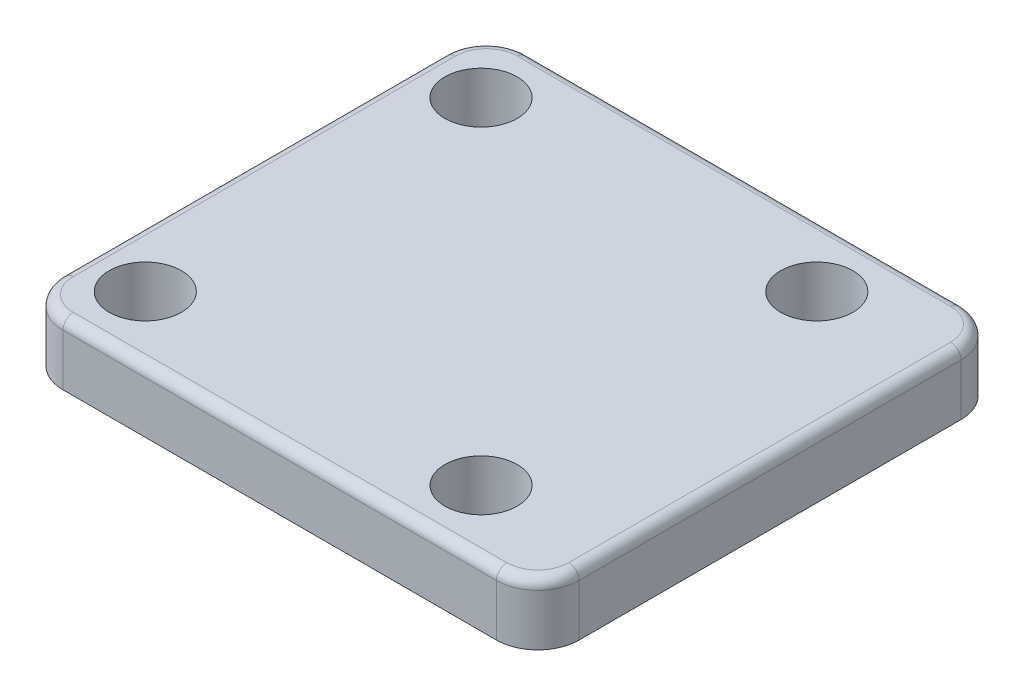
ISO-10303-21;
HEADER;
FILE_DESCRIPTION(('STEP AP214'),'2;1');
FILE_NAME('part.step','',(''),(''),'','','');
FILE_SCHEMA(('AUTOMOTIVE_DESIGN { 1 0 10303 214 1 1 1 1 }'));
ENDSEC;
DATA;
#1=APPLICATION_CONTEXT('core data for automotive mechanical design processes');
#2=APPLICATION_PROTOCOL_DEFINITION('international standard','automotive_design',2000,#1);
#3=PRODUCT_CONTEXT('',#1,'mechanical');
#4=PRODUCT('Part','Part','',(#3));
#5=PRODUCT_RELATED_PRODUCT_CATEGORY('part','',(#4));
#6=PRODUCT_DEFINITION_FORMATION('','',#4);
#7=PRODUCT_DEFINITION_CONTEXT('part definition',#1,'design');
#8=PRODUCT_DEFINITION('design','',#6,#7);
#9=PRODUCT_DEFINITION_SHAPE('','',#8);
#10=(LENGTH_UNIT() NAMED_UNIT(*) SI_UNIT(.MILLI.,.METRE.));
#11=(NAMED_UNIT(*) PLANE_ANGLE_UNIT() SI_UNIT($,.RADIAN.));
#12=(NAMED_UNIT(*) SI_UNIT($,.STERADIAN.) SOLID_ANGLE_UNIT());
#13=UNCERTAINTY_MEASURE_WITH_UNIT(LENGTH_MEASURE(1.E-05),#10,'distance_accuracy_value','');
#14=(GEOMETRIC_REPRESENTATION_CONTEXT(3) GLOBAL_UNCERTAINTY_ASSIGNED_CONTEXT((#13)) GLOBAL_UNIT_ASSIGNED_CONTEXT((#10,
#11,#12)) REPRESENTATION_CONTEXT('',''));
#15=CARTESIAN_POINT('',(0.,0.,0.));
#16=DIRECTION('',(0.,0.,1.));
#17=DIRECTION('',(1.,0.,0.));
#18=AXIS2_PLACEMENT_3D('',#15,#16,#17);
#19=CARTESIAN_POINT('',(24.,6.,-18.5));
#20=DIRECTION('',(0.,-1.,0.));
#21=DIRECTION('',(0.,0.,-1.));
#22=AXIS2_PLACEMENT_3D('',#19,#20,#21);
#23=CYLINDRICAL_SURFACE('',#22,4.);
#24=DIRECTION('',(0.,-1.,0.));
#25=VECTOR('',#24,1.);
#26=CARTESIAN_POINT('',(24.,6.,-22.5));
#27=LINE('',#26,#25);
#28=CARTESIAN_POINT('',(24.,5.,-22.5));
#29=VERTEX_POINT('',#28);
#30=CARTESIAN_POINT('',(24.,0.,-22.5));
#31=VERTEX_POINT('',#30);
#32=EDGE_CURVE('E133',#29,#31,#27,.T.);
#33=ORIENTED_EDGE('',*,*,#32,.F.);
#34=CARTESIAN_POINT('',(24.,5.,-18.5));
#35=DIRECTION('',(0.,-1.,0.));
#36=DIRECTION('',(0.,0.,-1.));
#37=AXIS2_PLACEMENT_3D('',#34,#35,#36);
#38=CIRCLE('',#37,4.);
#39=CARTESIAN_POINT('',(28.,5.,-18.5));
#40=VERTEX_POINT('',#39);
#41=EDGE_CURVE('E253',#29,#40,#38,.T.);
#42=ORIENTED_EDGE('',*,*,#41,.T.);
#43=DIRECTION('',(0.,-1.,0.));
#44=VECTOR('',#43,1.);
#45=CARTESIAN_POINT('',(28.,6.,-18.5));
#46=LINE('',#45,#44);
#47=CARTESIAN_POINT('',(28.,0.,-18.5));
#48=VERTEX_POINT('',#47);
#49=EDGE_CURVE('E156',#40,#48,#46,.T.);
#50=ORIENTED_EDGE('',*,*,#49,.T.);
#51=CARTESIAN_POINT('',(24.,0.,-18.5));
#52=DIRECTION('',(0.,1.,0.));
#53=DIRECTION('',(0.,0.,-1.));
#54=AXIS2_PLACEMENT_3D('',#51,#52,#53);
#55=CIRCLE('',#54,4.);
#56=EDGE_CURVE('E149',#48,#31,#55,.T.);
#57=ORIENTED_EDGE('',*,*,#56,.T.);
#58=EDGE_LOOP('',(#33,#42,#50,#57));
#59=FACE_BOUND('',#58,.T.);
#60=ADVANCED_FACE('F41',(#59),#23,.T.);
#61=CARTESIAN_POINT('',(-18.,6.,-22.5));
#62=DIRECTION('',(0.,0.,1.));
#63=DIRECTION('',(1.,0.,0.));
#64=AXIS2_PLACEMENT_3D('',#61,#62,#63);
#65=PLANE('',#64);
#66=DIRECTION('',(0.,-1.,0.));
#67=VECTOR('',#66,1.);
#68=CARTESIAN_POINT('',(-18.,6.,-22.5));
#69=LINE('',#68,#67);
#70=CARTESIAN_POINT('',(-18.,5.,-22.5));
#71=VERTEX_POINT('',#70);
#72=CARTESIAN_POINT('',(-18.,0.,-22.5));
#73=VERTEX_POINT('',#72);
#74=EDGE_CURVE('E143',#71,#73,#69,.T.);
#75=ORIENTED_EDGE('',*,*,#74,.F.);
#76=DIRECTION('',(-1.,0.,0.));
#77=VECTOR('',#76,1.);
#78=CARTESIAN_POINT('',(-18.,5.,-22.5));
#79=LINE('',#78,#77);
#80=EDGE_CURVE('E60',#71,#29,#79,.F.);
#81=ORIENTED_EDGE('',*,*,#80,.T.);
#82=ORIENTED_EDGE('',*,*,#32,.T.);
#83=DIRECTION('',(-1.,0.,0.));
#84=VECTOR('',#83,1.);
#85=CARTESIAN_POINT('',(-18.,0.,-22.5));
#86=LINE('',#85,#84);
#87=EDGE_CURVE('E136',#31,#73,#86,.T.);
#88=ORIENTED_EDGE('',*,*,#87,.T.);
#89=EDGE_LOOP('',(#75,#81,#82,#88));
#90=FACE_BOUND('',#89,.T.);
#91=ADVANCED_FACE('F135',(#90),#65,.F.);
#92=CARTESIAN_POINT('',(-18.,6.,-18.5));
#93=DIRECTION('',(0.,-1.,0.));
#94=DIRECTION('',(0.,0.,-1.));
#95=AXIS2_PLACEMENT_3D('',#92,#93,#94);
#96=CYLINDRICAL_SURFACE('',#95,4.);
#97=DIRECTION('',(0.,-1.,0.));
#98=VECTOR('',#97,1.);
#99=CARTESIAN_POINT('',(-22.,6.,-18.5));
#100=LINE('',#99,#98);
#101=CARTESIAN_POINT('',(-22.,5.,-18.5));
#102=VERTEX_POINT('',#101);
#103=CARTESIAN_POINT('',(-22.,0.,-18.5));
#104=VERTEX_POINT('',#103);
#105=EDGE_CURVE('E204',#102,#104,#100,.T.);
#106=ORIENTED_EDGE('',*,*,#105,.F.);
#107=CARTESIAN_POINT('',(-18.,5.,-18.5));
#108=DIRECTION('',(0.,-1.,0.));
#109=DIRECTION('',(0.,0.,-1.));
#110=AXIS2_PLACEMENT_3D('',#107,#108,#109);
#111=CIRCLE('',#110,4.);
#112=EDGE_CURVE('E68',#102,#71,#111,.T.);
#113=ORIENTED_EDGE('',*,*,#112,.T.);
#114=ORIENTED_EDGE('',*,*,#74,.T.);
#115=CARTESIAN_POINT('',(-18.,0.,-18.5));
#116=DIRECTION('',(0.,1.,0.));
#117=DIRECTION('',(0.,0.,1.));
#118=AXIS2_PLACEMENT_3D('',#115,#116,#117);
#119=CIRCLE('',#118,4.);
#120=EDGE_CURVE('E152',#73,#104,#119,.T.);
#121=ORIENTED_EDGE('',*,*,#120,.T.);
#122=EDGE_LOOP('',(#106,#113,#114,#121));
#123=FACE_BOUND('',#122,.T.);
#124=ADVANCED_FACE('F339',(#123),#96,.T.);
#125=CARTESIAN_POINT('',(-22.,6.,-18.5));
#126=DIRECTION('',(1.,0.,0.));
#127=DIRECTION('',(0.,0.,-1.));
#128=AXIS2_PLACEMENT_3D('',#125,#126,#127);
#129=PLANE('',#128);
#130=DIRECTION('',(0.,-1.,0.));
#131=VECTOR('',#130,1.);
#132=CARTESIAN_POINT('',(-22.,6.,18.5));
#133=LINE('',#132,#131);
#134=CARTESIAN_POINT('',(-22.,5.,18.5));
#135=VERTEX_POINT('',#134);
#136=CARTESIAN_POINT('',(-22.,0.,18.5));
#137=VERTEX_POINT('',#136);
#138=EDGE_CURVE('E201',#135,#137,#133,.T.);
#139=ORIENTED_EDGE('',*,*,#138,.F.);
#140=DIRECTION('',(0.,0.,1.));
#141=VECTOR('',#140,1.);
#142=CARTESIAN_POINT('',(-22.,5.,-18.5));
#143=LINE('',#142,#141);
#144=EDGE_CURVE('E246',#135,#102,#143,.F.);
#145=ORIENTED_EDGE('',*,*,#144,.T.);
#146=ORIENTED_EDGE('',*,*,#105,.T.);
#147=DIRECTION('',(0.,0.,1.));
#148=VECTOR('',#147,1.);
#149=CARTESIAN_POINT('',(-22.,0.,-18.5));
#150=LINE('',#149,#148);
#151=EDGE_CURVE('E171',#104,#137,#150,.T.);
#152=ORIENTED_EDGE('',*,*,#151,.T.);
#153=EDGE_LOOP('',(#139,#145,#146,#152));
#154=FACE_BOUND('',#153,.T.);
#155=ADVANCED_FACE('F405',(#154),#129,.F.);
#156=CARTESIAN_POINT('',(-18.,6.,18.5));
#157=DIRECTION('',(0.,-1.,0.));
#158=DIRECTION('',(0.,0.,-1.));
#159=AXIS2_PLACEMENT_3D('',#156,#157,#158);
#160=CYLINDRICAL_SURFACE('',#159,4.);
#161=DIRECTION('',(0.,-1.,0.));
#162=VECTOR('',#161,1.);
#163=CARTESIAN_POINT('',(-18.,6.,22.5));
#164=LINE('',#163,#162);
#165=CARTESIAN_POINT('',(-18.,5.,22.5));
#166=VERTEX_POINT('',#165);
#167=CARTESIAN_POINT('',(-18.,0.,22.5));
#168=VERTEX_POINT('',#167);
#169=EDGE_CURVE('E198',#166,#168,#164,.T.);
#170=ORIENTED_EDGE('',*,*,#169,.F.);
#171=CARTESIAN_POINT('',(-18.,5.,18.5));
#172=DIRECTION('',(0.,-1.,0.));
#173=DIRECTION('',(0.,0.,-1.));
#174=AXIS2_PLACEMENT_3D('',#171,#172,#173);
#175=CIRCLE('',#174,4.);
#176=EDGE_CURVE('E243',#166,#135,#175,.T.);
#177=ORIENTED_EDGE('',*,*,#176,.T.);
#178=ORIENTED_EDGE('',*,*,#138,.T.);
#179=CARTESIAN_POINT('',(-18.,0.,18.5));
#180=DIRECTION('',(0.,1.,0.));
#181=DIRECTION('',(0.,0.,1.));
#182=AXIS2_PLACEMENT_3D('',#179,#180,#181);
#183=CIRCLE('',#182,4.);
#184=EDGE_CURVE('E175',#137,#168,#183,.T.);
#185=ORIENTED_EDGE('',*,*,#184,.T.);
#186=EDGE_LOOP('',(#170,#177,#178,#185));
#187=FACE_BOUND('',#186,.T.);
#188=ADVANCED_FACE('F403',(#187),#160,.T.);
#189=CARTESIAN_POINT('',(-18.,6.,22.5));
#190=DIRECTION('',(0.,0.,-1.));
#191=DIRECTION('',(-1.,0.,0.));
#192=AXIS2_PLACEMENT_3D('',#189,#190,#191);
#193=PLANE('',#192);
#194=DIRECTION('',(0.,-1.,0.));
#195=VECTOR('',#194,1.);
#196=CARTESIAN_POINT('',(24.,6.,22.5));
#197=LINE('',#196,#195);
#198=CARTESIAN_POINT('',(24.,5.,22.5));
#199=VERTEX_POINT('',#198);
#200=CARTESIAN_POINT('',(24.,0.,22.5));
#201=VERTEX_POINT('',#200);
#202=EDGE_CURVE('E195',#199,#201,#197,.T.);
#203=ORIENTED_EDGE('',*,*,#202,.F.);
#204=DIRECTION('',(1.,0.,0.));
#205=VECTOR('',#204,1.);
#206=CARTESIAN_POINT('',(-18.,5.,22.5));
#207=LINE('',#206,#205);
#208=EDGE_CURVE('E240',#199,#166,#207,.F.);
#209=ORIENTED_EDGE('',*,*,#208,.T.);
#210=ORIENTED_EDGE('',*,*,#169,.T.);
#211=DIRECTION('',(1.,0.,0.));
#212=VECTOR('',#211,1.);
#213=CARTESIAN_POINT('',(-18.,0.,22.5));
#214=LINE('',#213,#212);
#215=EDGE_CURVE('E179',#168,#201,#214,.T.);
#216=ORIENTED_EDGE('',*,*,#215,.T.);
#217=EDGE_LOOP('',(#203,#209,#210,#216));
#218=FACE_BOUND('',#217,.T.);
#219=ADVANCED_FACE('F393',(#218),#193,.F.);
#220=CARTESIAN_POINT('',(24.,6.,18.5));
#221=DIRECTION('',(0.,-1.,0.));
#222=DIRECTION('',(0.,0.,-1.));
#223=AXIS2_PLACEMENT_3D('',#220,#221,#222);
#224=CYLINDRICAL_SURFACE('',#223,4.);
#225=DIRECTION('',(0.,-1.,0.));
#226=VECTOR('',#225,1.);
#227=CARTESIAN_POINT('',(28.,6.,18.5));
#228=LINE('',#227,#226);
#229=CARTESIAN_POINT('',(28.,5.,18.5));
#230=VERTEX_POINT('',#229);
#231=CARTESIAN_POINT('',(28.,0.,18.5));
#232=VERTEX_POINT('',#231);
#233=EDGE_CURVE('E192',#230,#232,#228,.T.);
#234=ORIENTED_EDGE('',*,*,#233,.F.);
#235=CARTESIAN_POINT('',(24.,5.,18.5));
#236=DIRECTION('',(0.,-1.,0.));
#237=DIRECTION('',(0.,0.,-1.));
#238=AXIS2_PLACEMENT_3D('',#235,#236,#237);
#239=CIRCLE('',#238,4.);
#240=EDGE_CURVE('E237',#230,#199,#239,.T.);
#241=ORIENTED_EDGE('',*,*,#240,.T.);
#242=ORIENTED_EDGE('',*,*,#202,.T.);
#243=CARTESIAN_POINT('',(24.,0.,18.5));
#244=DIRECTION('',(0.,1.,0.));
#245=DIRECTION('',(0.,0.,1.));
#246=AXIS2_PLACEMENT_3D('',#243,#244,#245);
#247=CIRCLE('',#246,4.);
#248=EDGE_CURVE('E183',#201,#232,#247,.T.);
#249=ORIENTED_EDGE('',*,*,#248,.T.);
#250=EDGE_LOOP('',(#234,#241,#242,#249));
#251=FACE_BOUND('',#250,.T.);
#252=ADVANCED_FACE('F390',(#251),#224,.T.);
#253=CARTESIAN_POINT('',(28.,6.,-18.5));
#254=DIRECTION('',(-1.,0.,0.));
#255=DIRECTION('',(0.,0.,1.));
#256=AXIS2_PLACEMENT_3D('',#253,#254,#255);
#257=PLANE('',#256);
#258=ORIENTED_EDGE('',*,*,#49,.F.);
#259=DIRECTION('',(0.,0.,-1.));
#260=VECTOR('',#259,1.);
#261=CARTESIAN_POINT('',(28.,5.,-18.5));
#262=LINE('',#261,#260);
#263=EDGE_CURVE('E233',#40,#230,#262,.F.);
#264=ORIENTED_EDGE('',*,*,#263,.T.);
#265=ORIENTED_EDGE('',*,*,#233,.T.);
#266=DIRECTION('',(0.,0.,-1.));
#267=VECTOR('',#266,1.);
#268=CARTESIAN_POINT('',(28.,0.,-18.5));
#269=LINE('',#268,#267);
#270=EDGE_CURVE('E187',#232,#48,#269,.T.);
#271=ORIENTED_EDGE('',*,*,#270,.T.);
#272=EDGE_LOOP('',(#258,#264,#265,#271));
#273=FACE_BOUND('',#272,.T.);
#274=ADVANCED_FACE('F381',(#273),#257,.F.);
#275=CARTESIAN_POINT('',(24.,6.,-18.5));
#276=DIRECTION('',(0.,-1.,0.));
#277=DIRECTION('',(0.,0.,-1.));
#278=AXIS2_PLACEMENT_3D('',#275,#276,#277);
#279=PLANE('',#278);
#280=CARTESIAN_POINT('',(-16.2634559672896,6.,16.2634559672907));
#281=DIRECTION('',(0.,1.,0.));
#282=DIRECTION('',(0.,0.,1.));
#283=AXIS2_PLACEMENT_3D('',#280,#281,#282);
#284=CIRCLE('',#283,3.50000000000049);
#285=CARTESIAN_POINT('',(-16.2634559672896,6.,19.7634559672912));
#286=VERTEX_POINT('',#285);
#287=EDGE_CURVE('E427',#286,#286,#284,.T.);
#288=ORIENTED_EDGE('',*,*,#287,.F.);
#289=EDGE_LOOP('',(#288));
#290=FACE_BOUND('',#289,.T.);
#291=CARTESIAN_POINT('',(16.2634559672916,6.,16.2634559672896));
#292=DIRECTION('',(0.,1.,0.));
#293=DIRECTION('',(0.,0.,1.));
#294=AXIS2_PLACEMENT_3D('',#291,#292,#293);
#295=CIRCLE('',#294,3.5000000000013);
#296=CARTESIAN_POINT('',(16.2634559672916,6.,19.7634559672909));
#297=VERTEX_POINT('',#296);
#298=EDGE_CURVE('E431',#297,#297,#295,.T.);
#299=ORIENTED_EDGE('',*,*,#298,.F.);
#300=EDGE_LOOP('',(#299));
#301=FACE_BOUND('',#300,.T.);
#302=CARTESIAN_POINT('',(16.2634559672905,6.,-16.2634559672916));
#303=DIRECTION('',(0.,1.,0.));
#304=DIRECTION('',(0.,0.,1.));
#305=AXIS2_PLACEMENT_3D('',#302,#303,#304);
#306=CIRCLE('',#305,3.50000000000096);
#307=CARTESIAN_POINT('',(16.2634559672905,6.,-12.7634559672906));
#308=VERTEX_POINT('',#307);
#309=EDGE_CURVE('E435',#308,#308,#306,.T.);
#310=ORIENTED_EDGE('',*,*,#309,.F.);
#311=EDGE_LOOP('',(#310));
#312=FACE_BOUND('',#311,.T.);
#313=CARTESIAN_POINT('',(-16.2634559672907,6.,-16.2634559672905));
#314=DIRECTION('',(0.,1.,0.));
#315=DIRECTION('',(0.,0.,1.));
#316=AXIS2_PLACEMENT_3D('',#313,#314,#315);
#317=CIRCLE('',#316,3.5);
#318=CARTESIAN_POINT('',(-16.2634559672907,6.,-12.7634559672905));
#319=VERTEX_POINT('',#318);
#320=EDGE_CURVE('E289',#319,#319,#317,.T.);
#321=ORIENTED_EDGE('',*,*,#320,.F.);
#322=EDGE_LOOP('',(#321));
#323=FACE_BOUND('',#322,.T.);
#324=CARTESIAN_POINT('',(24.,6.,18.5));
#325=DIRECTION('',(0.,-1.,0.));
#326=DIRECTION('',(0.,0.,-1.));
#327=AXIS2_PLACEMENT_3D('',#324,#325,#326);
#328=CIRCLE('',#327,3.);
#329=CARTESIAN_POINT('',(24.,6.,21.5));
#330=VERTEX_POINT('',#329);
#331=CARTESIAN_POINT('',(27.,6.,18.5));
#332=VERTEX_POINT('',#331);
#333=EDGE_CURVE('E226',#330,#332,#328,.F.);
#334=ORIENTED_EDGE('',*,*,#333,.T.);
#335=DIRECTION('',(0.,0.,-1.));
#336=VECTOR('',#335,1.);
#337=CARTESIAN_POINT('',(27.,6.,-18.5));
#338=LINE('',#337,#336);
#339=CARTESIAN_POINT('',(27.,6.,-18.5));
#340=VERTEX_POINT('',#339);
#341=EDGE_CURVE('E229',#332,#340,#338,.T.);
#342=ORIENTED_EDGE('',*,*,#341,.T.);
#343=CARTESIAN_POINT('',(24.,6.,-18.5));
#344=DIRECTION('',(0.,-1.,0.));
#345=DIRECTION('',(0.,0.,-1.));
#346=AXIS2_PLACEMENT_3D('',#343,#344,#345);
#347=CIRCLE('',#346,3.);
#348=CARTESIAN_POINT('',(24.,6.,-21.5));
#349=VERTEX_POINT('',#348);
#350=EDGE_CURVE('E142',#340,#349,#347,.F.);
#351=ORIENTED_EDGE('',*,*,#350,.T.);
#352=DIRECTION('',(-1.,0.,0.));
#353=VECTOR('',#352,1.);
#354=CARTESIAN_POINT('',(24.,6.,-21.5));
#355=LINE('',#354,#353);
#356=CARTESIAN_POINT('',(-18.,6.,-21.5));
#357=VERTEX_POINT('',#356);
#358=EDGE_CURVE('E211',#349,#357,#355,.T.);
#359=ORIENTED_EDGE('',*,*,#358,.T.);
#360=CARTESIAN_POINT('',(-18.,6.,-18.5));
#361=DIRECTION('',(0.,-1.,0.));
#362=DIRECTION('',(0.,0.,-1.));
#363=AXIS2_PLACEMENT_3D('',#360,#361,#362);
#364=CIRCLE('',#363,3.);
#365=CARTESIAN_POINT('',(-21.,6.,-18.5));
#366=VERTEX_POINT('',#365);
#367=EDGE_CURVE('E214',#357,#366,#364,.F.);
#368=ORIENTED_EDGE('',*,*,#367,.T.);
#369=DIRECTION('',(0.,0.,1.));
#370=VECTOR('',#369,1.);
#371=CARTESIAN_POINT('',(-21.,6.,-18.5));
#372=LINE('',#371,#370);
#373=CARTESIAN_POINT('',(-21.,6.,18.5));
#374=VERTEX_POINT('',#373);
#375=EDGE_CURVE('E217',#366,#374,#372,.T.);
#376=ORIENTED_EDGE('',*,*,#375,.T.);
#377=CARTESIAN_POINT('',(-18.,6.,18.5));
#378=DIRECTION('',(0.,-1.,0.));
#379=DIRECTION('',(0.,0.,-1.));
#380=AXIS2_PLACEMENT_3D('',#377,#378,#379);
#381=CIRCLE('',#380,3.);
#382=CARTESIAN_POINT('',(-18.,6.,21.5));
#383=VERTEX_POINT('',#382);
#384=EDGE_CURVE('E220',#374,#383,#381,.F.);
#385=ORIENTED_EDGE('',*,*,#384,.T.);
#386=DIRECTION('',(1.,0.,0.));
#387=VECTOR('',#386,1.);
#388=CARTESIAN_POINT('',(24.,6.,21.5));
#389=LINE('',#388,#387);
#390=EDGE_CURVE('E223',#383,#330,#389,.T.);
#391=ORIENTED_EDGE('',*,*,#390,.T.);
#392=EDGE_LOOP('',(#334,#342,#351,#359,#368,#376,#385,#391));
#393=FACE_BOUND('',#392,.T.);
#394=ADVANCED_FACE('F307',(#290,#301,#312,#323,#393),#279,.F.);
#395=CARTESIAN_POINT('',(24.,0.,-18.5));
#396=DIRECTION('',(0.,-1.,0.));
#397=DIRECTION('',(0.,0.,-1.));
#398=AXIS2_PLACEMENT_3D('',#395,#396,#397);
#399=PLANE('',#398);
#400=CARTESIAN_POINT('',(-16.2634559672896,0.,16.2634559672907));
#401=DIRECTION('',(0.,-1.,0.));
#402=DIRECTION('',(0.,0.,-1.));
#403=AXIS2_PLACEMENT_3D('',#400,#401,#402);
#404=CIRCLE('',#403,3.50000000000049);
#405=CARTESIAN_POINT('',(-16.2634559672896,0.,12.7634559672902));
#406=VERTEX_POINT('',#405);
#407=EDGE_CURVE('E46',#406,#406,#404,.T.);
#408=ORIENTED_EDGE('',*,*,#407,.F.);
#409=EDGE_LOOP('',(#408));
#410=FACE_BOUND('',#409,.T.);
#411=CARTESIAN_POINT('',(16.2634559672916,0.,16.2634559672896));
#412=DIRECTION('',(0.,-1.,0.));
#413=DIRECTION('',(0.,0.,-1.));
#414=AXIS2_PLACEMENT_3D('',#411,#412,#413);
#415=CIRCLE('',#414,3.5000000000013);
#416=CARTESIAN_POINT('',(16.2634559672916,0.,12.7634559672883));
#417=VERTEX_POINT('',#416);
#418=EDGE_CURVE('E292',#417,#417,#415,.T.);
#419=ORIENTED_EDGE('',*,*,#418,.F.);
#420=EDGE_LOOP('',(#419));
#421=FACE_BOUND('',#420,.T.);
#422=CARTESIAN_POINT('',(16.2634559672905,0.,-16.2634559672916));
#423=DIRECTION('',(0.,-1.,0.));
#424=DIRECTION('',(0.,0.,-1.));
#425=AXIS2_PLACEMENT_3D('',#422,#423,#424);
#426=CIRCLE('',#425,3.50000000000096);
#427=CARTESIAN_POINT('',(16.2634559672905,0.,-19.7634559672926));
#428=VERTEX_POINT('',#427);
#429=EDGE_CURVE('E288',#428,#428,#426,.T.);
#430=ORIENTED_EDGE('',*,*,#429,.F.);
#431=EDGE_LOOP('',(#430));
#432=FACE_BOUND('',#431,.T.);
#433=CARTESIAN_POINT('',(-16.2634559672907,0.,-16.2634559672905));
#434=DIRECTION('',(0.,-1.,0.));
#435=DIRECTION('',(0.,0.,-1.));
#436=AXIS2_PLACEMENT_3D('',#433,#434,#435);
#437=CIRCLE('',#436,3.5);
#438=CARTESIAN_POINT('',(-16.2634559672907,0.,-19.7634559672905));
#439=VERTEX_POINT('',#438);
#440=EDGE_CURVE('E284',#439,#439,#437,.T.);
#441=ORIENTED_EDGE('',*,*,#440,.F.);
#442=EDGE_LOOP('',(#441));
#443=FACE_BOUND('',#442,.T.);
#444=CARTESIAN_POINT('',(0.,0.,0.));
#445=DIRECTION('',(0.,-1.,0.));
#446=DIRECTION('',(0.,0.,-1.));
#447=AXIS2_PLACEMENT_3D('',#444,#445,#446);
#448=CIRCLE('',#447,16.);
#449=CARTESIAN_POINT('',(0.,0.,-16.));
#450=VERTEX_POINT('',#449);
#451=EDGE_CURVE('E166',#450,#450,#448,.T.);
#452=ORIENTED_EDGE('',*,*,#451,.F.);
#453=EDGE_LOOP('',(#452));
#454=FACE_BOUND('',#453,.T.);
#455=ORIENTED_EDGE('',*,*,#56,.F.);
#456=ORIENTED_EDGE('',*,*,#270,.F.);
#457=ORIENTED_EDGE('',*,*,#248,.F.);
#458=ORIENTED_EDGE('',*,*,#215,.F.);
#459=ORIENTED_EDGE('',*,*,#184,.F.);
#460=ORIENTED_EDGE('',*,*,#151,.F.);
#461=ORIENTED_EDGE('',*,*,#120,.F.);
#462=ORIENTED_EDGE('',*,*,#87,.F.);
#463=EDGE_LOOP('',(#455,#456,#457,#458,#459,#460,#461,#462));
#464=FACE_BOUND('',#463,.T.);
#465=ADVANCED_FACE('F147',(#410,#421,#432,#443,#454,#464),#399,.T.);
#466=CARTESIAN_POINT('',(-21.,5.,-18.5));
#467=DIRECTION('',(0.,0.,1.));
#468=DIRECTION('',(1.,0.,0.));
#469=AXIS2_PLACEMENT_3D('',#466,#467,#468);
#470=CYLINDRICAL_SURFACE('',#469,1.);
#471=CARTESIAN_POINT('',(-21.,5.,-18.5));
#472=DIRECTION('',(0.,0.,-1.));
#473=DIRECTION('',(-1.,0.,0.));
#474=AXIS2_PLACEMENT_3D('',#471,#472,#473);
#475=CIRCLE('',#474,1.);
#476=EDGE_CURVE('E163',#102,#366,#475,.T.);
#477=ORIENTED_EDGE('',*,*,#476,.F.);
#478=ORIENTED_EDGE('',*,*,#144,.F.);
#479=CARTESIAN_POINT('',(-21.,5.,18.5));
#480=DIRECTION('',(0.,0.,1.));
#481=DIRECTION('',(1.,0.,0.));
#482=AXIS2_PLACEMENT_3D('',#479,#480,#481);
#483=CIRCLE('',#482,1.);
#484=EDGE_CURVE('E159',#374,#135,#483,.T.);
#485=ORIENTED_EDGE('',*,*,#484,.F.);
#486=ORIENTED_EDGE('',*,*,#375,.F.);
#487=EDGE_LOOP('',(#477,#478,#485,#486));
#488=FACE_BOUND('',#487,.T.);
#489=ADVANCED_FACE('F306',(#488),#470,.T.);
#490=CARTESIAN_POINT('',(-18.,5.,18.5));
#491=DIRECTION('',(0.,-1.,0.));
#492=DIRECTION('',(0.,0.,-1.));
#493=AXIS2_PLACEMENT_3D('',#490,#491,#492);
#494=TOROIDAL_SURFACE('',#493,3.,1.);
#495=ORIENTED_EDGE('',*,*,#484,.T.);
#496=ORIENTED_EDGE('',*,*,#176,.F.);
#497=CARTESIAN_POINT('',(-18.,5.,21.5));
#498=DIRECTION('',(1.,0.,0.));
#499=DIRECTION('',(0.,0.,-1.));
#500=AXIS2_PLACEMENT_3D('',#497,#498,#499);
#501=CIRCLE('',#500,1.);
#502=EDGE_CURVE('E274',#383,#166,#501,.T.);
#503=ORIENTED_EDGE('',*,*,#502,.F.);
#504=ORIENTED_EDGE('',*,*,#384,.F.);
#505=EDGE_LOOP('',(#495,#496,#503,#504));
#506=FACE_BOUND('',#505,.T.);
#507=ADVANCED_FACE('F361',(#506),#494,.T.);
#508=CARTESIAN_POINT('',(-18.,5.,-18.5));
#509=DIRECTION('',(0.,-1.,0.));
#510=DIRECTION('',(0.,0.,-1.));
#511=AXIS2_PLACEMENT_3D('',#508,#509,#510);
#512=TOROIDAL_SURFACE('',#511,3.,1.);
#513=ORIENTED_EDGE('',*,*,#476,.T.);
#514=ORIENTED_EDGE('',*,*,#367,.F.);
#515=CARTESIAN_POINT('',(-18.,5.,-21.5));
#516=DIRECTION('',(1.,0.,0.));
#517=DIRECTION('',(0.,0.,-1.));
#518=AXIS2_PLACEMENT_3D('',#515,#516,#517);
#519=CIRCLE('',#518,1.);
#520=EDGE_CURVE('E270',#71,#357,#519,.T.);
#521=ORIENTED_EDGE('',*,*,#520,.F.);
#522=ORIENTED_EDGE('',*,*,#112,.F.);
#523=EDGE_LOOP('',(#513,#514,#521,#522));
#524=FACE_BOUND('',#523,.T.);
#525=ADVANCED_FACE('F357',(#524),#512,.T.);
#526=CARTESIAN_POINT('',(24.,5.,21.5));
#527=DIRECTION('',(1.,0.,0.));
#528=DIRECTION('',(0.,0.,-1.));
#529=AXIS2_PLACEMENT_3D('',#526,#527,#528);
#530=CYLINDRICAL_SURFACE('',#529,1.);
#531=ORIENTED_EDGE('',*,*,#502,.T.);
#532=ORIENTED_EDGE('',*,*,#208,.F.);
#533=CARTESIAN_POINT('',(24.,5.,21.5));
#534=DIRECTION('',(1.,0.,0.));
#535=DIRECTION('',(0.,0.,-1.));
#536=AXIS2_PLACEMENT_3D('',#533,#534,#535);
#537=CIRCLE('',#536,1.);
#538=EDGE_CURVE('E266',#330,#199,#537,.T.);
#539=ORIENTED_EDGE('',*,*,#538,.F.);
#540=ORIENTED_EDGE('',*,*,#390,.F.);
#541=EDGE_LOOP('',(#531,#532,#539,#540));
#542=FACE_BOUND('',#541,.T.);
#543=ADVANCED_FACE('F353',(#542),#530,.T.);
#544=CARTESIAN_POINT('',(24.,5.,-21.5));
#545=DIRECTION('',(-1.,0.,0.));
#546=DIRECTION('',(0.,0.,1.));
#547=AXIS2_PLACEMENT_3D('',#544,#545,#546);
#548=CYLINDRICAL_SURFACE('',#547,1.);
#549=ORIENTED_EDGE('',*,*,#520,.T.);
#550=ORIENTED_EDGE('',*,*,#358,.F.);
#551=CARTESIAN_POINT('',(24.,5.,-21.5));
#552=DIRECTION('',(1.,0.,0.));
#553=DIRECTION('',(0.,0.,-1.));
#554=AXIS2_PLACEMENT_3D('',#551,#552,#553);
#555=CIRCLE('',#554,1.);
#556=EDGE_CURVE('E262',#29,#349,#555,.T.);
#557=ORIENTED_EDGE('',*,*,#556,.F.);
#558=ORIENTED_EDGE('',*,*,#80,.F.);
#559=EDGE_LOOP('',(#549,#550,#557,#558));
#560=FACE_BOUND('',#559,.T.);
#561=ADVANCED_FACE('F349',(#560),#548,.T.);
#562=CARTESIAN_POINT('',(24.,5.,18.5));
#563=DIRECTION('',(0.,-1.,0.));
#564=DIRECTION('',(0.,0.,-1.));
#565=AXIS2_PLACEMENT_3D('',#562,#563,#564);
#566=TOROIDAL_SURFACE('',#565,3.,1.);
#567=ORIENTED_EDGE('',*,*,#538,.T.);
#568=ORIENTED_EDGE('',*,*,#240,.F.);
#569=CARTESIAN_POINT('',(27.,5.,18.5));
#570=DIRECTION('',(0.,0.,-1.));
#571=DIRECTION('',(-1.,0.,0.));
#572=AXIS2_PLACEMENT_3D('',#569,#570,#571);
#573=CIRCLE('',#572,1.);
#574=EDGE_CURVE('E259',#332,#230,#573,.T.);
#575=ORIENTED_EDGE('',*,*,#574,.F.);
#576=ORIENTED_EDGE('',*,*,#333,.F.);
#577=EDGE_LOOP('',(#567,#568,#575,#576));
#578=FACE_BOUND('',#577,.T.);
#579=ADVANCED_FACE('F345',(#578),#566,.T.);
#580=CARTESIAN_POINT('',(24.,5.,-18.5));
#581=DIRECTION('',(0.,-1.,0.));
#582=DIRECTION('',(0.,0.,-1.));
#583=AXIS2_PLACEMENT_3D('',#580,#581,#582);
#584=TOROIDAL_SURFACE('',#583,3.,1.);
#585=ORIENTED_EDGE('',*,*,#556,.T.);
#586=ORIENTED_EDGE('',*,*,#350,.F.);
#587=CARTESIAN_POINT('',(27.,5.,-18.5));
#588=DIRECTION('',(0.,0.,1.));
#589=DIRECTION('',(0.,-1.,0.));
#590=AXIS2_PLACEMENT_3D('',#587,#588,#589);
#591=CIRCLE('',#590,1.);
#592=EDGE_CURVE('E256',#40,#340,#591,.T.);
#593=ORIENTED_EDGE('',*,*,#592,.F.);
#594=ORIENTED_EDGE('',*,*,#41,.F.);
#595=EDGE_LOOP('',(#585,#586,#593,#594));
#596=FACE_BOUND('',#595,.T.);
#597=ADVANCED_FACE('F330',(#596),#584,.T.);
#598=CARTESIAN_POINT('',(27.,5.,-18.5));
#599=DIRECTION('',(0.,0.,-1.));
#600=DIRECTION('',(-1.,0.,0.));
#601=AXIS2_PLACEMENT_3D('',#598,#599,#600);
#602=CYLINDRICAL_SURFACE('',#601,1.);
#603=ORIENTED_EDGE('',*,*,#574,.T.);
#604=ORIENTED_EDGE('',*,*,#263,.F.);
#605=ORIENTED_EDGE('',*,*,#592,.T.);
#606=ORIENTED_EDGE('',*,*,#341,.F.);
#607=EDGE_LOOP('',(#603,#604,#605,#606));
#608=FACE_BOUND('',#607,.T.);
#609=ADVANCED_FACE('F321',(#608),#602,.T.);
#610=CARTESIAN_POINT('',(0.,-2.,0.));
#611=DIRECTION('',(0.,1.,0.));
#612=DIRECTION('',(0.,0.,1.));
#613=AXIS2_PLACEMENT_3D('',#610,#611,#612);
#614=CYLINDRICAL_SURFACE('',#613,16.);
#615=CARTESIAN_POINT('',(0.,-0.999999999999987,0.));
#616=DIRECTION('',(0.,-1.,0.));
#617=DIRECTION('',(0.,0.,-1.));
#618=AXIS2_PLACEMENT_3D('',#615,#616,#617);
#619=CIRCLE('',#618,16.);
#620=CARTESIAN_POINT('',(0.,-0.999999999999987,-16.));
#621=VERTEX_POINT('',#620);
#622=EDGE_CURVE('E11',#621,#621,#619,.F.);
#623=ORIENTED_EDGE('',*,*,#622,.T.);
#624=EDGE_LOOP('',(#623));
#625=FACE_BOUND('',#624,.T.);
#626=ORIENTED_EDGE('',*,*,#451,.T.);
#627=EDGE_LOOP('',(#626));
#628=FACE_BOUND('',#627,.T.);
#629=ADVANCED_FACE('F318',(#625,#628),#614,.T.);
#630=CARTESIAN_POINT('',(0.,-2.,0.));
#631=DIRECTION('',(0.,-1.,0.));
#632=DIRECTION('',(0.,0.,-1.));
#633=AXIS2_PLACEMENT_3D('',#630,#631,#632);
#634=PLANE('',#633);
#635=CARTESIAN_POINT('',(0.,-2.,0.));
#636=DIRECTION('',(0.,-1.,0.));
#637=DIRECTION('',(0.,0.,-1.));
#638=AXIS2_PLACEMENT_3D('',#635,#636,#637);
#639=CIRCLE('',#638,14.2679491924311);
#640=CARTESIAN_POINT('',(0.,-2.,-14.2679491924311));
#641=VERTEX_POINT('',#640);
#642=EDGE_CURVE('E52',#641,#641,#639,.T.);
#643=ORIENTED_EDGE('',*,*,#642,.T.);
#644=EDGE_LOOP('',(#643));
#645=FACE_BOUND('',#644,.T.);
#646=ADVANCED_FACE('F320',(#645),#634,.T.);
#647=CARTESIAN_POINT('',(0.,-2.,0.));
#648=DIRECTION('',(0.,1.,0.));
#649=DIRECTION('',(0.,0.,1.));
#650=AXIS2_PLACEMENT_3D('',#647,#648,#649);
#651=CONICAL_SURFACE('',#650,14.2679491924311,1.0471975511966);
#652=ORIENTED_EDGE('',*,*,#622,.F.);
#653=EDGE_LOOP('',(#652));
#654=FACE_BOUND('',#653,.T.);
#655=ORIENTED_EDGE('',*,*,#642,.F.);
#656=EDGE_LOOP('',(#655));
#657=FACE_BOUND('',#656,.T.);
#658=ADVANCED_FACE('F44',(#654,#657),#651,.T.);
#659=CARTESIAN_POINT('',(-16.2634559672907,-2.,-16.2634559672905));
#660=DIRECTION('',(0.,1.,0.));
#661=DIRECTION('',(0.,0.,1.));
#662=AXIS2_PLACEMENT_3D('',#659,#660,#661);
#663=CYLINDRICAL_SURFACE('',#662,3.5);
#664=ORIENTED_EDGE('',*,*,#440,.T.);
#665=EDGE_LOOP('',(#664));
#666=FACE_BOUND('',#665,.T.);
#667=ORIENTED_EDGE('',*,*,#320,.T.);
#668=EDGE_LOOP('',(#667));
#669=FACE_BOUND('',#668,.T.);
#670=ADVANCED_FACE('F457',(#666,#669),#663,.F.);
#671=CARTESIAN_POINT('',(16.2634559672905,-2.,-16.2634559672916));
#672=DIRECTION('',(0.,1.,0.));
#673=DIRECTION('',(0.,0.,1.));
#674=AXIS2_PLACEMENT_3D('',#671,#672,#673);
#675=CYLINDRICAL_SURFACE('',#674,3.50000000000096);
#676=ORIENTED_EDGE('',*,*,#429,.T.);
#677=EDGE_LOOP('',(#676));
#678=FACE_BOUND('',#677,.T.);
#679=ORIENTED_EDGE('',*,*,#309,.T.);
#680=EDGE_LOOP('',(#679));
#681=FACE_BOUND('',#680,.T.);
#682=ADVANCED_FACE('F450',(#678,#681),#675,.F.);
#683=CARTESIAN_POINT('',(16.2634559672916,-2.,16.2634559672896));
#684=DIRECTION('',(0.,1.,0.));
#685=DIRECTION('',(0.,0.,1.));
#686=AXIS2_PLACEMENT_3D('',#683,#684,#685);
#687=CYLINDRICAL_SURFACE('',#686,3.5000000000013);
#688=ORIENTED_EDGE('',*,*,#418,.T.);
#689=EDGE_LOOP('',(#688));
#690=FACE_BOUND('',#689,.T.);
#691=ORIENTED_EDGE('',*,*,#298,.T.);
#692=EDGE_LOOP('',(#691));
#693=FACE_BOUND('',#692,.T.);
#694=ADVANCED_FACE('F448',(#690,#693),#687,.F.);
#695=CARTESIAN_POINT('',(-16.2634559672896,-2.,16.2634559672907));
#696=DIRECTION('',(0.,1.,0.));
#697=DIRECTION('',(0.,0.,1.));
#698=AXIS2_PLACEMENT_3D('',#695,#696,#697);
#699=CYLINDRICAL_SURFACE('',#698,3.50000000000049);
#700=ORIENTED_EDGE('',*,*,#407,.T.);
#701=EDGE_LOOP('',(#700));
#702=FACE_BOUND('',#701,.T.);
#703=ORIENTED_EDGE('',*,*,#287,.T.);
#704=EDGE_LOOP('',(#703));
#705=FACE_BOUND('',#704,.T.);
#706=ADVANCED_FACE('F301',(#702,#705),#699,.F.);
#707=CLOSED_SHELL('',(#60,#91,#124,#155,#188,#219,#252,#274,#394,#465,#489,#507,#525,#543,#561,
#579,#597,#609,#629,#646,#658,#670,#682,#694,#706));
#708=MANIFOLD_SOLID_BREP('B2',#707);
#709=ADVANCED_BREP_SHAPE_REPRESENTATION('',(#18,#708),#14);
#710=SHAPE_DEFINITION_REPRESENTATION(#9,#709);
ENDSEC;
END-ISO-10303-21;
